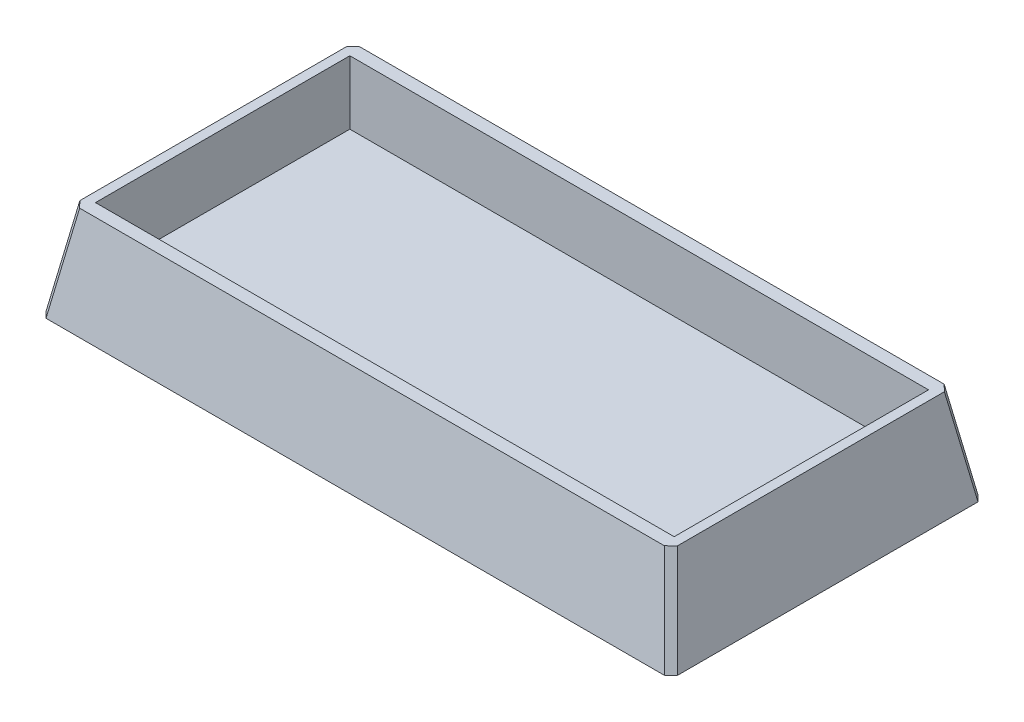
ISO-10303-21;
HEADER;
FILE_DESCRIPTION(('STEP AP214'),'2;1');
FILE_NAME('part.step','',(''),(''),'','','');
FILE_SCHEMA(('AUTOMOTIVE_DESIGN { 1 0 10303 214 1 1 1 1 }'));
ENDSEC;
DATA;
#1=APPLICATION_CONTEXT('core data for automotive mechanical design processes');
#2=APPLICATION_PROTOCOL_DEFINITION('international standard','automotive_design',2000,#1);
#3=PRODUCT_CONTEXT('',#1,'mechanical');
#4=PRODUCT('Part','Part','',(#3));
#5=PRODUCT_RELATED_PRODUCT_CATEGORY('part','',(#4));
#6=PRODUCT_DEFINITION_FORMATION('','',#4);
#7=PRODUCT_DEFINITION_CONTEXT('part definition',#1,'design');
#8=PRODUCT_DEFINITION('design','',#6,#7);
#9=PRODUCT_DEFINITION_SHAPE('','',#8);
#10=(LENGTH_UNIT() NAMED_UNIT(*) SI_UNIT(.MILLI.,.METRE.));
#11=(NAMED_UNIT(*) PLANE_ANGLE_UNIT() SI_UNIT($,.RADIAN.));
#12=(NAMED_UNIT(*) SI_UNIT($,.STERADIAN.) SOLID_ANGLE_UNIT());
#13=UNCERTAINTY_MEASURE_WITH_UNIT(LENGTH_MEASURE(1.E-05),#10,'distance_accuracy_value','');
#14=(GEOMETRIC_REPRESENTATION_CONTEXT(3) GLOBAL_UNCERTAINTY_ASSIGNED_CONTEXT((#13)) GLOBAL_UNIT_ASSIGNED_CONTEXT((#10,
#11,#12)) REPRESENTATION_CONTEXT('',''));
#15=CARTESIAN_POINT('',(0.,0.,0.));
#16=DIRECTION('',(0.,0.,1.));
#17=DIRECTION('',(1.,0.,0.));
#18=AXIS2_PLACEMENT_3D('',#15,#16,#17);
#19=CARTESIAN_POINT('',(0.,10.,0.));
#20=DIRECTION('',(0.,1.,0.));
#21=DIRECTION('',(0.,0.,1.));
#22=AXIS2_PLACEMENT_3D('',#19,#20,#21);
#23=PLANE('',#22);
#24=DIRECTION('',(0.,0.,1.));
#25=VECTOR('',#24,1.);
#26=CARTESIAN_POINT('',(-47.002441327956,10.,25.));
#27=LINE('',#26,#25);
#28=CARTESIAN_POINT('',(-47.002441327956,10.,-20.9554290706377));
#29=VERTEX_POINT('',#28);
#30=CARTESIAN_POINT('',(-47.002441327956,10.,20.9554290706377));
#31=VERTEX_POINT('',#30);
#32=EDGE_CURVE('E169',#29,#31,#27,.T.);
#33=ORIENTED_EDGE('',*,*,#32,.T.);
#34=DIRECTION('',(-0.696032820063175,0.,-0.718009967476012));
#35=VECTOR('',#34,1.);
#36=CARTESIAN_POINT('',(-34.7042131791561,10.,33.6419722028004));
#37=LINE('',#36,#35);
#38=CARTESIAN_POINT('',(-45.9874764568362,10.,22.002441327956));
#39=VERTEX_POINT('',#38);
#40=EDGE_CURVE('E194',#31,#39,#37,.F.);
#41=ORIENTED_EDGE('',*,*,#40,.T.);
#42=DIRECTION('',(1.,0.,0.));
#43=VECTOR('',#42,1.);
#44=CARTESIAN_POINT('',(50.,10.,22.002441327956));
#45=LINE('',#44,#43);
#46=CARTESIAN_POINT('',(45.9554290706377,10.,22.002441327956));
#47=VERTEX_POINT('',#46);
#48=EDGE_CURVE('E160',#39,#47,#45,.T.);
#49=ORIENTED_EDGE('',*,*,#48,.T.);
#50=DIRECTION('',(-0.718009967476016,0.,0.696032820063171));
#51=VECTOR('',#50,1.);
#52=CARTESIAN_POINT('',(33.2595518055326,10.,34.3097179066786));
#53=LINE('',#52,#51);
#54=CARTESIAN_POINT('',(47.002441327956,10.,20.9874764568362));
#55=VERTEX_POINT('',#54);
#56=EDGE_CURVE('E188',#47,#55,#53,.F.);
#57=ORIENTED_EDGE('',*,*,#56,.T.);
#58=DIRECTION('',(0.,0.,-1.));
#59=VECTOR('',#58,1.);
#60=CARTESIAN_POINT('',(47.002441327956,10.,-25.));
#61=LINE('',#60,#59);
#62=CARTESIAN_POINT('',(47.002441327956,10.,-20.9874764568363));
#63=VERTEX_POINT('',#62);
#64=EDGE_CURVE('E163',#55,#63,#61,.T.);
#65=ORIENTED_EDGE('',*,*,#64,.T.);
#66=DIRECTION('',(0.718009967476021,0.,0.696032820063166));
#67=VECTOR('',#66,1.);
#68=CARTESIAN_POINT('',(33.2595518055323,10.,-34.3097179066787));
#69=LINE('',#68,#67);
#70=CARTESIAN_POINT('',(45.9554290706377,10.,-22.002441327956));
#71=VERTEX_POINT('',#70);
#72=EDGE_CURVE('E190',#63,#71,#69,.F.);
#73=ORIENTED_EDGE('',*,*,#72,.T.);
#74=DIRECTION('',(-1.,0.,0.));
#75=VECTOR('',#74,1.);
#76=CARTESIAN_POINT('',(-50.,10.,-22.002441327956));
#77=LINE('',#76,#75);
#78=CARTESIAN_POINT('',(-45.9874764568363,10.,-22.002441327956));
#79=VERTEX_POINT('',#78);
#80=EDGE_CURVE('E166',#71,#79,#77,.T.);
#81=ORIENTED_EDGE('',*,*,#80,.T.);
#82=DIRECTION('',(0.696032820063168,0.,-0.718009967476018));
#83=VECTOR('',#82,1.);
#84=CARTESIAN_POINT('',(-34.7042131791566,10.,-33.6419722028002));
#85=LINE('',#84,#83);
#86=EDGE_CURVE('E192',#79,#29,#85,.F.);
#87=ORIENTED_EDGE('',*,*,#86,.T.);
#88=EDGE_LOOP('',(#33,#41,#49,#57,#65,#73,#81,#87));
#89=FACE_BOUND('',#88,.T.);
#90=DIRECTION('',(-1.,0.,0.));
#91=VECTOR('',#90,1.);
#92=CARTESIAN_POINT('',(-45.5,10.,-20.));
#93=LINE('',#92,#91);
#94=CARTESIAN_POINT('',(45.5,10.,-20.));
#95=VERTEX_POINT('',#94);
#96=CARTESIAN_POINT('',(-45.5,10.,-20.));
#97=VERTEX_POINT('',#96);
#98=EDGE_CURVE('E151',#95,#97,#93,.T.);
#99=ORIENTED_EDGE('',*,*,#98,.F.);
#100=DIRECTION('',(0.,0.,-1.));
#101=VECTOR('',#100,1.);
#102=CARTESIAN_POINT('',(45.5,10.,-20.));
#103=LINE('',#102,#101);
#104=CARTESIAN_POINT('',(45.5,10.,20.));
#105=VERTEX_POINT('',#104);
#106=EDGE_CURVE('E149',#105,#95,#103,.T.);
#107=ORIENTED_EDGE('',*,*,#106,.F.);
#108=DIRECTION('',(1.,0.,0.));
#109=VECTOR('',#108,1.);
#110=CARTESIAN_POINT('',(-45.5,10.,20.));
#111=LINE('',#110,#109);
#112=CARTESIAN_POINT('',(-45.5,10.,20.));
#113=VERTEX_POINT('',#112);
#114=EDGE_CURVE('E131',#113,#105,#111,.T.);
#115=ORIENTED_EDGE('',*,*,#114,.F.);
#116=DIRECTION('',(0.,0.,1.));
#117=VECTOR('',#116,1.);
#118=CARTESIAN_POINT('',(-45.5,10.,-20.));
#119=LINE('',#118,#117);
#120=EDGE_CURVE('E395',#97,#113,#119,.T.);
#121=ORIENTED_EDGE('',*,*,#120,.F.);
#122=EDGE_LOOP('',(#99,#107,#115,#121));
#123=FACE_BOUND('',#122,.T.);
#124=ADVANCED_FACE('F35',(#89,#123),#23,.T.);
#125=CARTESIAN_POINT('',(45.5,10.,-20.));
#126=DIRECTION('',(-1.,0.,0.));
#127=DIRECTION('',(0.,0.,1.));
#128=AXIS2_PLACEMENT_3D('',#125,#126,#127);
#129=PLANE('',#128);
#130=DIRECTION('',(0.,0.,-1.));
#131=VECTOR('',#130,1.);
#132=CARTESIAN_POINT('',(45.5,0.,-20.));
#133=LINE('',#132,#131);
#134=CARTESIAN_POINT('',(45.5,0.,20.));
#135=VERTEX_POINT('',#134);
#136=CARTESIAN_POINT('',(45.5,0.,-20.));
#137=VERTEX_POINT('',#136);
#138=EDGE_CURVE('E138',#135,#137,#133,.T.);
#139=ORIENTED_EDGE('',*,*,#138,.F.);
#140=DIRECTION('',(0.,-1.,0.));
#141=VECTOR('',#140,1.);
#142=CARTESIAN_POINT('',(45.5,10.,20.));
#143=LINE('',#142,#141);
#144=EDGE_CURVE('E124',#105,#135,#143,.T.);
#145=ORIENTED_EDGE('',*,*,#144,.F.);
#146=ORIENTED_EDGE('',*,*,#106,.T.);
#147=DIRECTION('',(0.,-1.,0.));
#148=VECTOR('',#147,1.);
#149=CARTESIAN_POINT('',(45.5,10.,-20.));
#150=LINE('',#149,#148);
#151=EDGE_CURVE('E141',#95,#137,#150,.T.);
#152=ORIENTED_EDGE('',*,*,#151,.T.);
#153=EDGE_LOOP('',(#139,#145,#146,#152));
#154=FACE_BOUND('',#153,.T.);
#155=ADVANCED_FACE('F139',(#154),#129,.T.);
#156=CARTESIAN_POINT('',(-45.5,10.,-20.));
#157=DIRECTION('',(0.,0.,1.));
#158=DIRECTION('',(1.,0.,0.));
#159=AXIS2_PLACEMENT_3D('',#156,#157,#158);
#160=PLANE('',#159);
#161=DIRECTION('',(-1.,0.,0.));
#162=VECTOR('',#161,1.);
#163=CARTESIAN_POINT('',(-45.5,0.,-20.));
#164=LINE('',#163,#162);
#165=CARTESIAN_POINT('',(-45.5,0.,-20.));
#166=VERTEX_POINT('',#165);
#167=EDGE_CURVE('E144',#137,#166,#164,.T.);
#168=ORIENTED_EDGE('',*,*,#167,.F.);
#169=ORIENTED_EDGE('',*,*,#151,.F.);
#170=ORIENTED_EDGE('',*,*,#98,.T.);
#171=DIRECTION('',(0.,-1.,0.));
#172=VECTOR('',#171,1.);
#173=CARTESIAN_POINT('',(-45.5,10.,-20.));
#174=LINE('',#173,#172);
#175=EDGE_CURVE('E157',#97,#166,#174,.T.);
#176=ORIENTED_EDGE('',*,*,#175,.T.);
#177=EDGE_LOOP('',(#168,#169,#170,#176));
#178=FACE_BOUND('',#177,.T.);
#179=ADVANCED_FACE('F258',(#178),#160,.T.);
#180=CARTESIAN_POINT('',(-45.5,10.,-20.));
#181=DIRECTION('',(1.,0.,0.));
#182=DIRECTION('',(0.,0.,-1.));
#183=AXIS2_PLACEMENT_3D('',#180,#181,#182);
#184=PLANE('',#183);
#185=DIRECTION('',(0.,0.,1.));
#186=VECTOR('',#185,1.);
#187=CARTESIAN_POINT('',(-45.5,0.,-20.));
#188=LINE('',#187,#186);
#189=CARTESIAN_POINT('',(-45.5,0.,20.));
#190=VERTEX_POINT('',#189);
#191=EDGE_CURVE('E148',#166,#190,#188,.T.);
#192=ORIENTED_EDGE('',*,*,#191,.F.);
#193=ORIENTED_EDGE('',*,*,#175,.F.);
#194=ORIENTED_EDGE('',*,*,#120,.T.);
#195=DIRECTION('',(0.,-1.,0.));
#196=VECTOR('',#195,1.);
#197=CARTESIAN_POINT('',(-45.5,10.,20.));
#198=LINE('',#197,#196);
#199=EDGE_CURVE('E134',#113,#190,#198,.T.);
#200=ORIENTED_EDGE('',*,*,#199,.T.);
#201=EDGE_LOOP('',(#192,#193,#194,#200));
#202=FACE_BOUND('',#201,.T.);
#203=ADVANCED_FACE('F356',(#202),#184,.T.);
#204=CARTESIAN_POINT('',(-45.5,10.,20.));
#205=DIRECTION('',(0.,0.,-1.));
#206=DIRECTION('',(-1.,0.,0.));
#207=AXIS2_PLACEMENT_3D('',#204,#205,#206);
#208=PLANE('',#207);
#209=DIRECTION('',(1.,0.,0.));
#210=VECTOR('',#209,1.);
#211=CARTESIAN_POINT('',(-45.5,0.,20.));
#212=LINE('',#211,#210);
#213=EDGE_CURVE('E128',#190,#135,#212,.T.);
#214=ORIENTED_EDGE('',*,*,#213,.F.);
#215=ORIENTED_EDGE('',*,*,#199,.F.);
#216=ORIENTED_EDGE('',*,*,#114,.T.);
#217=ORIENTED_EDGE('',*,*,#144,.T.);
#218=EDGE_LOOP('',(#214,#215,#216,#217));
#219=FACE_BOUND('',#218,.T.);
#220=ADVANCED_FACE('F126',(#219),#208,.T.);
#221=CARTESIAN_POINT('',(0.,0.,0.));
#222=DIRECTION('',(0.,1.,0.));
#223=DIRECTION('',(0.,0.,1.));
#224=AXIS2_PLACEMENT_3D('',#221,#222,#223);
#225=PLANE('',#224);
#226=ORIENTED_EDGE('',*,*,#213,.T.);
#227=ORIENTED_EDGE('',*,*,#138,.T.);
#228=ORIENTED_EDGE('',*,*,#167,.T.);
#229=ORIENTED_EDGE('',*,*,#191,.T.);
#230=EDGE_LOOP('',(#226,#227,#228,#229));
#231=FACE_BOUND('',#230,.T.);
#232=ADVANCED_FACE('F146',(#231),#225,.T.);
#233=CARTESIAN_POINT('',(0.,-5.,0.));
#234=DIRECTION('',(0.,1.,0.));
#235=DIRECTION('',(0.,0.,1.));
#236=AXIS2_PLACEMENT_3D('',#233,#234,#235);
#237=PLANE('',#236);
#238=DIRECTION('',(-1.,0.,0.));
#239=VECTOR('',#238,1.);
#240=CARTESIAN_POINT('',(0.,-5.,24.6473460385831));
#241=LINE('',#240,#239);
#242=CARTESIAN_POINT('',(48.6003337812647,-5.,24.6473460385831));
#243=VERTEX_POINT('',#242);
#244=CARTESIAN_POINT('',(-48.6323811674633,-5.,24.6473460385831));
#245=VERTEX_POINT('',#244);
#246=EDGE_CURVE('E172',#243,#245,#241,.T.);
#247=ORIENTED_EDGE('',*,*,#246,.T.);
#248=DIRECTION('',(0.696032820063175,0.,0.718009967476012));
#249=VECTOR('',#248,1.);
#250=CARTESIAN_POINT('',(-49.6971875362433,-5.,23.5489185446804));
#251=LINE('',#250,#249);
#252=CARTESIAN_POINT('',(-49.647346038583,-5.,23.6003337812648));
#253=VERTEX_POINT('',#252);
#254=EDGE_CURVE('E206',#245,#253,#251,.F.);
#255=ORIENTED_EDGE('',*,*,#254,.T.);
#256=DIRECTION('',(0.,0.,-1.));
#257=VECTOR('',#256,1.);
#258=CARTESIAN_POINT('',(-49.6473460385831,-5.,0.));
#259=LINE('',#258,#257);
#260=CARTESIAN_POINT('',(-49.6473460385831,-5.,-23.6003337812648));
#261=VERTEX_POINT('',#260);
#262=EDGE_CURVE('E179',#253,#261,#259,.T.);
#263=ORIENTED_EDGE('',*,*,#262,.T.);
#264=DIRECTION('',(-0.696032820063168,0.,0.718009967476018));
#265=VECTOR('',#264,1.);
#266=CARTESIAN_POINT('',(-49.6971875362434,-5.,-23.5489185446804));
#267=LINE('',#266,#265);
#268=CARTESIAN_POINT('',(-48.6323811674634,-5.,-24.6473460385831));
#269=VERTEX_POINT('',#268);
#270=EDGE_CURVE('E204',#261,#269,#267,.F.);
#271=ORIENTED_EDGE('',*,*,#270,.T.);
#272=DIRECTION('',(1.,0.,0.));
#273=VECTOR('',#272,1.);
#274=CARTESIAN_POINT('',(0.,-5.,-24.6473460385831));
#275=LINE('',#274,#273);
#276=CARTESIAN_POINT('',(48.6003337812648,-5.,-24.6473460385831));
#277=VERTEX_POINT('',#276);
#278=EDGE_CURVE('E177',#269,#277,#275,.T.);
#279=ORIENTED_EDGE('',*,*,#278,.T.);
#280=DIRECTION('',(-0.718009967476021,0.,-0.696032820063166));
#281=VECTOR('',#280,1.);
#282=CARTESIAN_POINT('',(48.5373712502157,-5.,-24.7083813863212));
#283=LINE('',#282,#281);
#284=CARTESIAN_POINT('',(49.647346038583,-5.,-23.6323811674634));
#285=VERTEX_POINT('',#284);
#286=EDGE_CURVE('E57',#277,#285,#283,.F.);
#287=ORIENTED_EDGE('',*,*,#286,.T.);
#288=DIRECTION('',(0.,0.,1.));
#289=VECTOR('',#288,1.);
#290=CARTESIAN_POINT('',(49.6473460385831,-5.,0.));
#291=LINE('',#290,#289);
#292=CARTESIAN_POINT('',(49.6473460385831,-5.,23.6323811674633));
#293=VERTEX_POINT('',#292);
#294=EDGE_CURVE('E175',#285,#293,#291,.T.);
#295=ORIENTED_EDGE('',*,*,#294,.T.);
#296=DIRECTION('',(0.718009967476016,0.,-0.696032820063171));
#297=VECTOR('',#296,1.);
#298=CARTESIAN_POINT('',(48.5373712502157,-5.,24.7083813863212));
#299=LINE('',#298,#297);
#300=EDGE_CURVE('E201',#293,#243,#299,.F.);
#301=ORIENTED_EDGE('',*,*,#300,.T.);
#302=EDGE_LOOP('',(#247,#255,#263,#271,#279,#287,#295,#301));
#303=FACE_BOUND('',#302,.T.);
#304=ADVANCED_FACE('F230',(#303),#237,.F.);
#305=CARTESIAN_POINT('',(47.002441327956,10.,0.));
#306=DIRECTION('',(0.984807753012207,0.173648177666937,0.));
#307=DIRECTION('',(0.,0.,1.));
#308=AXIS2_PLACEMENT_3D('',#305,#306,#307);
#309=PLANE('',#308);
#310=ORIENTED_EDGE('',*,*,#294,.F.);
#311=DIRECTION('',(-0.171087869746042,0.970287525247811,0.171087869746042));
#312=VECTOR('',#311,1.);
#313=CARTESIAN_POINT('',(46.38811566267,13.4840139768609,-20.3731507915503));
#314=LINE('',#313,#312);
#315=EDGE_CURVE('E11',#285,#63,#314,.T.);
#316=ORIENTED_EDGE('',*,*,#315,.T.);
#317=ORIENTED_EDGE('',*,*,#64,.F.);
#318=DIRECTION('',(0.171087869746042,-0.970287525247811,0.171087869746042));
#319=VECTOR('',#318,1.);
#320=CARTESIAN_POINT('',(46.38811566267,13.4840139768609,20.3731507915502));
#321=LINE('',#320,#319);
#322=EDGE_CURVE('E44',#55,#293,#321,.T.);
#323=ORIENTED_EDGE('',*,*,#322,.T.);
#324=EDGE_LOOP('',(#310,#316,#317,#323));
#325=FACE_BOUND('',#324,.T.);
#326=ADVANCED_FACE('F242',(#325),#309,.T.);
#327=CARTESIAN_POINT('',(0.,10.,-22.002441327956));
#328=DIRECTION('',(0.,0.173648177666937,-0.984807753012207));
#329=DIRECTION('',(1.,0.,0.));
#330=AXIS2_PLACEMENT_3D('',#327,#328,#329);
#331=PLANE('',#330);
#332=ORIENTED_EDGE('',*,*,#278,.F.);
#333=DIRECTION('',(0.171087869746042,0.970287525247811,0.171087869746042));
#334=VECTOR('',#333,1.);
#335=CARTESIAN_POINT('',(-44.6413743121943,17.6341246202561,-20.656339183314));
#336=LINE('',#335,#334);
#337=EDGE_CURVE('E211',#269,#79,#336,.T.);
#338=ORIENTED_EDGE('',*,*,#337,.T.);
#339=ORIENTED_EDGE('',*,*,#80,.F.);
#340=DIRECTION('',(0.171087869746042,-0.970287525247812,-0.171087869746042));
#341=VECTOR('',#340,1.);
#342=CARTESIAN_POINT('',(44.6102649869335,17.6288046123138,-20.6572772442518));
#343=LINE('',#342,#341);
#344=EDGE_CURVE('E208',#71,#277,#343,.T.);
#345=ORIENTED_EDGE('',*,*,#344,.T.);
#346=EDGE_LOOP('',(#332,#338,#339,#345));
#347=FACE_BOUND('',#346,.T.);
#348=ADVANCED_FACE('F216',(#347),#331,.T.);
#349=CARTESIAN_POINT('',(0.,10.,22.002441327956));
#350=DIRECTION('',(0.,0.173648177666937,0.984807753012207));
#351=DIRECTION('',(-1.,0.,0.));
#352=AXIS2_PLACEMENT_3D('',#349,#350,#351);
#353=PLANE('',#352);
#354=ORIENTED_EDGE('',*,*,#48,.F.);
#355=DIRECTION('',(-0.171087869746042,-0.970287525247812,0.171087869746042));
#356=VECTOR('',#355,1.);
#357=CARTESIAN_POINT('',(-44.6413743121943,17.6341246202561,20.656339183314));
#358=LINE('',#357,#356);
#359=EDGE_CURVE('E199',#39,#245,#358,.T.);
#360=ORIENTED_EDGE('',*,*,#359,.T.);
#361=ORIENTED_EDGE('',*,*,#246,.F.);
#362=DIRECTION('',(-0.171087869746042,0.970287525247811,-0.171087869746042));
#363=VECTOR('',#362,1.);
#364=CARTESIAN_POINT('',(44.6102649869335,17.6288046123138,20.6572772442518));
#365=LINE('',#364,#363);
#366=EDGE_CURVE('E196',#243,#47,#365,.T.);
#367=ORIENTED_EDGE('',*,*,#366,.T.);
#368=EDGE_LOOP('',(#354,#360,#361,#367));
#369=FACE_BOUND('',#368,.T.);
#370=ADVANCED_FACE('F238',(#369),#353,.T.);
#371=CARTESIAN_POINT('',(-47.002441327956,10.,0.));
#372=DIRECTION('',(-0.984807753012207,0.173648177666937,0.));
#373=DIRECTION('',(0.,0.,-1.));
#374=AXIS2_PLACEMENT_3D('',#371,#372,#373);
#375=PLANE('',#374);
#376=ORIENTED_EDGE('',*,*,#262,.F.);
#377=DIRECTION('',(0.171087869746042,0.970287525247811,-0.171087869746042));
#378=VECTOR('',#377,1.);
#379=CARTESIAN_POINT('',(-46.3890537236078,13.4786939689186,20.3420414662895));
#380=LINE('',#379,#378);
#381=EDGE_CURVE('E185',#253,#31,#380,.T.);
#382=ORIENTED_EDGE('',*,*,#381,.T.);
#383=ORIENTED_EDGE('',*,*,#32,.F.);
#384=DIRECTION('',(-0.171087869746042,-0.970287525247811,-0.171087869746042));
#385=VECTOR('',#384,1.);
#386=CARTESIAN_POINT('',(-46.3890537236078,13.4786939689187,-20.3420414662895));
#387=LINE('',#386,#385);
#388=EDGE_CURVE('E182',#29,#261,#387,.T.);
#389=ORIENTED_EDGE('',*,*,#388,.T.);
#390=EDGE_LOOP('',(#376,#382,#383,#389));
#391=FACE_BOUND('',#390,.T.);
#392=ADVANCED_FACE('F228',(#391),#375,.T.);
#393=CARTESIAN_POINT('',(-46.3890537236078,13.4786939689186,20.3420414662895));
#394=DIRECTION('',(0.696681039223022,-0.241927278412651,-0.675356736508179));
#395=DIRECTION('',(0.171087869746042,0.970287525247811,-0.171087869746042));
#396=AXIS2_PLACEMENT_3D('',#393,#394,#395);
#397=PLANE('',#396);
#398=ORIENTED_EDGE('',*,*,#254,.F.);
#399=ORIENTED_EDGE('',*,*,#359,.F.);
#400=ORIENTED_EDGE('',*,*,#40,.F.);
#401=ORIENTED_EDGE('',*,*,#381,.F.);
#402=EDGE_LOOP('',(#398,#399,#400,#401));
#403=FACE_BOUND('',#402,.T.);
#404=ADVANCED_FACE('F235',(#403),#397,.F.);
#405=CARTESIAN_POINT('',(-46.3890537236078,13.4786939689187,-20.3420414662895));
#406=DIRECTION('',(0.696681039223028,-0.241927278412651,0.675356736508173));
#407=DIRECTION('',(-0.171087869746042,-0.970287525247811,-0.171087869746042));
#408=AXIS2_PLACEMENT_3D('',#405,#406,#407);
#409=PLANE('',#408);
#410=ORIENTED_EDGE('',*,*,#86,.F.);
#411=ORIENTED_EDGE('',*,*,#337,.F.);
#412=ORIENTED_EDGE('',*,*,#270,.F.);
#413=ORIENTED_EDGE('',*,*,#388,.F.);
#414=EDGE_LOOP('',(#410,#411,#412,#413));
#415=FACE_BOUND('',#414,.T.);
#416=ADVANCED_FACE('F225',(#415),#409,.F.);
#417=CARTESIAN_POINT('',(44.6102649869335,17.6288046123138,-20.6572772442518));
#418=DIRECTION('',(-0.67535673650817,-0.241927278412651,0.69668103922303));
#419=DIRECTION('',(0.171087869746042,-0.970287525247811,-0.171087869746042));
#420=AXIS2_PLACEMENT_3D('',#417,#418,#419);
#421=PLANE('',#420);
#422=ORIENTED_EDGE('',*,*,#72,.F.);
#423=ORIENTED_EDGE('',*,*,#315,.F.);
#424=ORIENTED_EDGE('',*,*,#286,.F.);
#425=ORIENTED_EDGE('',*,*,#344,.F.);
#426=EDGE_LOOP('',(#422,#423,#424,#425));
#427=FACE_BOUND('',#426,.T.);
#428=ADVANCED_FACE('F245',(#427),#421,.F.);
#429=CARTESIAN_POINT('',(44.6102649869335,17.6288046123138,20.6572772442518));
#430=DIRECTION('',(-0.675356736508175,-0.241927278412651,-0.696681039223025));
#431=DIRECTION('',(-0.171087869746042,0.970287525247811,-0.171087869746042));
#432=AXIS2_PLACEMENT_3D('',#429,#430,#431);
#433=PLANE('',#432);
#434=ORIENTED_EDGE('',*,*,#300,.F.);
#435=ORIENTED_EDGE('',*,*,#322,.F.);
#436=ORIENTED_EDGE('',*,*,#56,.F.);
#437=ORIENTED_EDGE('',*,*,#366,.F.);
#438=EDGE_LOOP('',(#434,#435,#436,#437));
#439=FACE_BOUND('',#438,.T.);
#440=ADVANCED_FACE('F38',(#439),#433,.F.);
#441=CLOSED_SHELL('',(#124,#155,#179,#203,#220,#232,#304,#326,#348,#370,#392,#404,#416,#428,#440));
#442=MANIFOLD_SOLID_BREP('B2',#441);
#443=ADVANCED_BREP_SHAPE_REPRESENTATION('',(#18,#442),#14);
#444=SHAPE_DEFINITION_REPRESENTATION(#9,#443);
ENDSEC;
END-ISO-10303-21;
